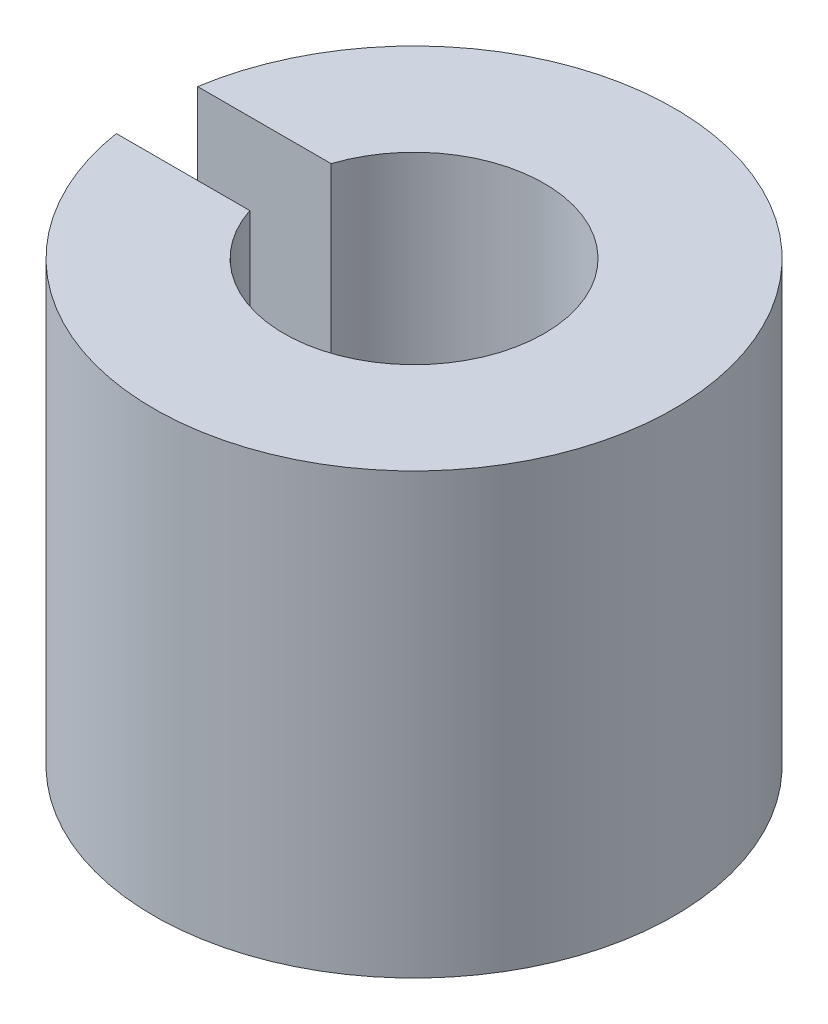
ISO-10303-21;
HEADER;
FILE_DESCRIPTION(('STEP AP214'),'2;1');
FILE_NAME('part.step','',(''),(''),'','','');
FILE_SCHEMA(('AUTOMOTIVE_DESIGN { 1 0 10303 214 1 1 1 1 }'));
ENDSEC;
DATA;
#1=APPLICATION_CONTEXT('core data for automotive mechanical design processes');
#2=APPLICATION_PROTOCOL_DEFINITION('international standard','automotive_design',2000,#1);
#3=PRODUCT_CONTEXT('',#1,'mechanical');
#4=PRODUCT('Part','Part','',(#3));
#5=PRODUCT_RELATED_PRODUCT_CATEGORY('part','',(#4));
#6=PRODUCT_DEFINITION_FORMATION('','',#4);
#7=PRODUCT_DEFINITION_CONTEXT('part definition',#1,'design');
#8=PRODUCT_DEFINITION('design','',#6,#7);
#9=PRODUCT_DEFINITION_SHAPE('','',#8);
#10=(LENGTH_UNIT() NAMED_UNIT(*) SI_UNIT(.MILLI.,.METRE.));
#11=(NAMED_UNIT(*) PLANE_ANGLE_UNIT() SI_UNIT($,.RADIAN.));
#12=(NAMED_UNIT(*) SI_UNIT($,.STERADIAN.) SOLID_ANGLE_UNIT());
#13=UNCERTAINTY_MEASURE_WITH_UNIT(LENGTH_MEASURE(1.E-05),#10,'distance_accuracy_value','');
#14=(GEOMETRIC_REPRESENTATION_CONTEXT(3) GLOBAL_UNCERTAINTY_ASSIGNED_CONTEXT((#13)) GLOBAL_UNIT_ASSIGNED_CONTEXT((#10,
#11,#12)) REPRESENTATION_CONTEXT('',''));
#15=CARTESIAN_POINT('',(0.,0.,0.));
#16=DIRECTION('',(0.,0.,1.));
#17=DIRECTION('',(1.,0.,0.));
#18=AXIS2_PLACEMENT_3D('',#15,#16,#17);
#19=CARTESIAN_POINT('',(0.,17.145,0.));
#20=DIRECTION('',(0.,-1.,0.));
#21=DIRECTION('',(0.,0.,-1.));
#22=AXIS2_PLACEMENT_3D('',#19,#20,#21);
#23=CYLINDRICAL_SURFACE('',#22,5.08);
#24=DIRECTION('',(0.,-1.,0.));
#25=VECTOR('',#24,1.);
#26=CARTESIAN_POINT('',(-4.82558221875869,17.145,-1.5875));
#27=LINE('',#26,#25);
#28=CARTESIAN_POINT('',(-4.82558221875869,17.145,-1.5875));
#29=VERTEX_POINT('',#28);
#30=CARTESIAN_POINT('',(-4.82558221875869,0.,-1.5875));
#31=VERTEX_POINT('',#30);
#32=EDGE_CURVE('E80',#29,#31,#27,.T.);
#33=ORIENTED_EDGE('',*,*,#32,.T.);
#34=CARTESIAN_POINT('',(0.,0.,0.));
#35=DIRECTION('',(0.,1.,0.));
#36=DIRECTION('',(0.,0.,1.));
#37=AXIS2_PLACEMENT_3D('',#34,#35,#36);
#38=CIRCLE('',#37,5.08);
#39=CARTESIAN_POINT('',(-4.82558221875869,0.,1.5875));
#40=VERTEX_POINT('',#39);
#41=EDGE_CURVE('E102',#40,#31,#38,.T.);
#42=ORIENTED_EDGE('',*,*,#41,.F.);
#43=DIRECTION('',(0.,-1.,0.));
#44=VECTOR('',#43,1.);
#45=CARTESIAN_POINT('',(-4.82558221875869,17.145,1.5875));
#46=LINE('',#45,#44);
#47=CARTESIAN_POINT('',(-4.82558221875869,17.145,1.5875));
#48=VERTEX_POINT('',#47);
#49=EDGE_CURVE('E61',#40,#48,#46,.F.);
#50=ORIENTED_EDGE('',*,*,#49,.T.);
#51=CARTESIAN_POINT('',(0.,17.145,0.));
#52=DIRECTION('',(0.,1.,0.));
#53=DIRECTION('',(0.,0.,1.));
#54=AXIS2_PLACEMENT_3D('',#51,#52,#53);
#55=CIRCLE('',#54,5.08);
#56=EDGE_CURVE('E45',#48,#29,#55,.T.);
#57=ORIENTED_EDGE('',*,*,#56,.T.);
#58=EDGE_LOOP('',(#33,#42,#50,#57));
#59=FACE_BOUND('',#58,.T.);
#60=ADVANCED_FACE('F37',(#59),#23,.F.);
#61=CARTESIAN_POINT('',(0.,17.145,0.));
#62=DIRECTION('',(0.,-1.,0.));
#63=DIRECTION('',(0.,0.,-1.));
#64=AXIS2_PLACEMENT_3D('',#61,#62,#63);
#65=CYLINDRICAL_SURFACE('',#64,10.16);
#66=CARTESIAN_POINT('',(0.,0.,0.));
#67=DIRECTION('',(0.,1.,0.));
#68=DIRECTION('',(0.,0.,1.));
#69=AXIS2_PLACEMENT_3D('',#66,#67,#68);
#70=CIRCLE('',#69,10.16);
#71=CARTESIAN_POINT('',(-10.0352101995922,0.,1.5875));
#72=VERTEX_POINT('',#71);
#73=CARTESIAN_POINT('',(-10.0352101995922,0.,-1.5875));
#74=VERTEX_POINT('',#73);
#75=EDGE_CURVE('E40',#72,#74,#70,.T.);
#76=ORIENTED_EDGE('',*,*,#75,.T.);
#77=DIRECTION('',(0.,-1.,0.));
#78=VECTOR('',#77,1.);
#79=CARTESIAN_POINT('',(-10.0352101995922,17.145,-1.5875));
#80=LINE('',#79,#78);
#81=CARTESIAN_POINT('',(-10.0352101995922,17.145,-1.5875));
#82=VERTEX_POINT('',#81);
#83=EDGE_CURVE('E53',#82,#74,#80,.T.);
#84=ORIENTED_EDGE('',*,*,#83,.F.);
#85=CARTESIAN_POINT('',(0.,17.145,0.));
#86=DIRECTION('',(0.,1.,0.));
#87=DIRECTION('',(0.,0.,1.));
#88=AXIS2_PLACEMENT_3D('',#85,#86,#87);
#89=CIRCLE('',#88,10.16);
#90=CARTESIAN_POINT('',(-10.0352101995922,17.145,1.5875));
#91=VERTEX_POINT('',#90);
#92=EDGE_CURVE('E11',#91,#82,#89,.T.);
#93=ORIENTED_EDGE('',*,*,#92,.F.);
#94=DIRECTION('',(0.,-1.,0.));
#95=VECTOR('',#94,1.);
#96=CARTESIAN_POINT('',(-10.0352101995922,17.145,1.5875));
#97=LINE('',#96,#95);
#98=EDGE_CURVE('E92',#72,#91,#97,.F.);
#99=ORIENTED_EDGE('',*,*,#98,.F.);
#100=EDGE_LOOP('',(#76,#84,#93,#99));
#101=FACE_BOUND('',#100,.T.);
#102=ADVANCED_FACE('F89',(#101),#65,.T.);
#103=CARTESIAN_POINT('',(0.,17.145,0.));
#104=DIRECTION('',(0.,1.,0.));
#105=DIRECTION('',(0.,0.,1.));
#106=AXIS2_PLACEMENT_3D('',#103,#104,#105);
#107=PLANE('',#106);
#108=DIRECTION('',(1.,0.,0.));
#109=VECTOR('',#108,1.);
#110=CARTESIAN_POINT('',(-10.161,17.145,-1.5875));
#111=LINE('',#110,#109);
#112=EDGE_CURVE('E77',#82,#29,#111,.T.);
#113=ORIENTED_EDGE('',*,*,#112,.T.);
#114=ORIENTED_EDGE('',*,*,#56,.F.);
#115=DIRECTION('',(1.,0.,0.));
#116=VECTOR('',#115,1.);
#117=CARTESIAN_POINT('',(-10.161,17.145,1.5875));
#118=LINE('',#117,#116);
#119=EDGE_CURVE('E84',#91,#48,#118,.T.);
#120=ORIENTED_EDGE('',*,*,#119,.F.);
#121=ORIENTED_EDGE('',*,*,#92,.T.);
#122=EDGE_LOOP('',(#113,#114,#120,#121));
#123=FACE_BOUND('',#122,.T.);
#124=ADVANCED_FACE('F95',(#123),#107,.T.);
#125=CARTESIAN_POINT('',(0.,0.,0.));
#126=DIRECTION('',(0.,1.,0.));
#127=DIRECTION('',(0.,0.,1.));
#128=AXIS2_PLACEMENT_3D('',#125,#126,#127);
#129=PLANE('',#128);
#130=ORIENTED_EDGE('',*,*,#41,.T.);
#131=DIRECTION('',(1.,0.,0.));
#132=VECTOR('',#131,1.);
#133=CARTESIAN_POINT('',(-10.161,0.,-1.5875));
#134=LINE('',#133,#132);
#135=EDGE_CURVE('E98',#74,#31,#134,.T.);
#136=ORIENTED_EDGE('',*,*,#135,.F.);
#137=ORIENTED_EDGE('',*,*,#75,.F.);
#138=DIRECTION('',(1.,0.,0.));
#139=VECTOR('',#138,1.);
#140=CARTESIAN_POINT('',(-10.161,0.,1.5875));
#141=LINE('',#140,#139);
#142=EDGE_CURVE('E96',#72,#40,#141,.T.);
#143=ORIENTED_EDGE('',*,*,#142,.T.);
#144=EDGE_LOOP('',(#130,#136,#137,#143));
#145=FACE_BOUND('',#144,.T.);
#146=ADVANCED_FACE('F110',(#145),#129,.F.);
#147=CARTESIAN_POINT('',(-10.161,17.145,1.5875));
#148=DIRECTION('',(0.,0.,1.));
#149=DIRECTION('',(0.,-1.,0.));
#150=AXIS2_PLACEMENT_3D('',#147,#148,#149);
#151=PLANE('',#150);
#152=ORIENTED_EDGE('',*,*,#142,.F.);
#153=ORIENTED_EDGE('',*,*,#98,.T.);
#154=ORIENTED_EDGE('',*,*,#119,.T.);
#155=ORIENTED_EDGE('',*,*,#49,.F.);
#156=EDGE_LOOP('',(#152,#153,#154,#155));
#157=FACE_BOUND('',#156,.T.);
#158=ADVANCED_FACE('F109',(#157),#151,.F.);
#159=CARTESIAN_POINT('',(-10.161,17.145,-1.5875));
#160=DIRECTION('',(0.,0.,-1.));
#161=DIRECTION('',(0.,1.,0.));
#162=AXIS2_PLACEMENT_3D('',#159,#160,#161);
#163=PLANE('',#162);
#164=ORIENTED_EDGE('',*,*,#112,.F.);
#165=ORIENTED_EDGE('',*,*,#83,.T.);
#166=ORIENTED_EDGE('',*,*,#135,.T.);
#167=ORIENTED_EDGE('',*,*,#32,.F.);
#168=EDGE_LOOP('',(#164,#165,#166,#167));
#169=FACE_BOUND('',#168,.T.);
#170=ADVANCED_FACE('F78',(#169),#163,.F.);
#171=CLOSED_SHELL('',(#60,#102,#124,#146,#158,#170));
#172=MANIFOLD_SOLID_BREP('B2',#171);
#173=ADVANCED_BREP_SHAPE_REPRESENTATION('',(#18,#172),#14);
#174=SHAPE_DEFINITION_REPRESENTATION(#9,#173);
ENDSEC;
END-ISO-10303-21;
